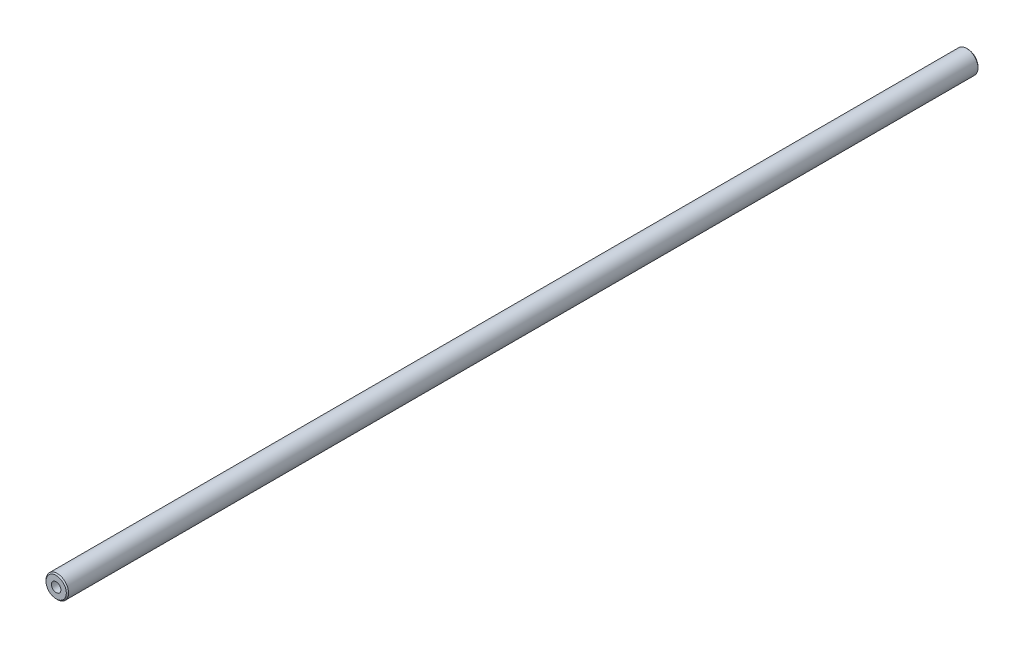
ISO-10303-21;
HEADER;
FILE_DESCRIPTION(('STEP AP214'),'2;1');
FILE_NAME('part.step','',(''),(''),'','','');
FILE_SCHEMA(('AUTOMOTIVE_DESIGN { 1 0 10303 214 1 1 1 1 }'));
ENDSEC;
DATA;
#1=APPLICATION_CONTEXT('core data for automotive mechanical design processes');
#2=APPLICATION_PROTOCOL_DEFINITION('international standard','automotive_design',2000,#1);
#3=PRODUCT_CONTEXT('',#1,'mechanical');
#4=PRODUCT('Part','Part','',(#3));
#5=PRODUCT_RELATED_PRODUCT_CATEGORY('part','',(#4));
#6=PRODUCT_DEFINITION_FORMATION('','',#4);
#7=PRODUCT_DEFINITION_CONTEXT('part definition',#1,'design');
#8=PRODUCT_DEFINITION('design','',#6,#7);
#9=PRODUCT_DEFINITION_SHAPE('','',#8);
#10=(LENGTH_UNIT() NAMED_UNIT(*) SI_UNIT(.MILLI.,.METRE.));
#11=(NAMED_UNIT(*) PLANE_ANGLE_UNIT() SI_UNIT($,.RADIAN.));
#12=(NAMED_UNIT(*) SI_UNIT($,.STERADIAN.) SOLID_ANGLE_UNIT());
#13=UNCERTAINTY_MEASURE_WITH_UNIT(LENGTH_MEASURE(1.E-05),#10,'distance_accuracy_value','');
#14=(GEOMETRIC_REPRESENTATION_CONTEXT(3) GLOBAL_UNCERTAINTY_ASSIGNED_CONTEXT((#13)) GLOBAL_UNIT_ASSIGNED_CONTEXT((#10,
#11,#12)) REPRESENTATION_CONTEXT('',''));
#15=CARTESIAN_POINT('',(0.,0.,0.));
#16=DIRECTION('',(0.,0.,1.));
#17=DIRECTION('',(1.,0.,0.));
#18=AXIS2_PLACEMENT_3D('',#15,#16,#17);
#19=CARTESIAN_POINT('',(0.,0.,403.4811));
#20=DIRECTION('',(0.,0.,-1.));
#21=DIRECTION('',(-1.,0.,0.));
#22=AXIS2_PLACEMENT_3D('',#19,#20,#21);
#23=CYLINDRICAL_SURFACE('',#22,5.00000000000001);
#24=CARTESIAN_POINT('',(0.,0.,0.5));
#25=DIRECTION('',(0.,0.,1.));
#26=DIRECTION('',(1.,0.,0.));
#27=AXIS2_PLACEMENT_3D('',#24,#25,#26);
#28=CIRCLE('',#27,5.00000000000001);
#29=CARTESIAN_POINT('',(5.00000000000001,0.,0.5));
#30=VERTEX_POINT('',#29);
#31=EDGE_CURVE('E75',#30,#30,#28,.T.);
#32=ORIENTED_EDGE('',*,*,#31,.T.);
#33=EDGE_LOOP('',(#32));
#34=FACE_BOUND('',#33,.T.);
#35=CARTESIAN_POINT('',(0.,0.,402.9811));
#36=DIRECTION('',(0.,0.,1.));
#37=DIRECTION('',(1.,0.,0.));
#38=AXIS2_PLACEMENT_3D('',#35,#36,#37);
#39=CIRCLE('',#38,5.00000000000001);
#40=CARTESIAN_POINT('',(5.00000000000001,0.,402.9811));
#41=VERTEX_POINT('',#40);
#42=EDGE_CURVE('E72',#41,#41,#39,.F.);
#43=ORIENTED_EDGE('',*,*,#42,.T.);
#44=EDGE_LOOP('',(#43));
#45=FACE_BOUND('',#44,.T.);
#46=ADVANCED_FACE('F37',(#34,#45),#23,.T.);
#47=CARTESIAN_POINT('',(0.,0.,403.4811));
#48=DIRECTION('',(0.,0.,1.));
#49=DIRECTION('',(1.,0.,0.));
#50=AXIS2_PLACEMENT_3D('',#47,#48,#49);
#51=PLANE('',#50);
#52=CARTESIAN_POINT('',(0.,0.,403.4811));
#53=DIRECTION('',(0.,0.,1.));
#54=DIRECTION('',(1.,0.,0.));
#55=AXIS2_PLACEMENT_3D('',#52,#53,#54);
#56=CIRCLE('',#55,2.09999999999999);
#57=CARTESIAN_POINT('',(2.09999999999999,0.,403.4811));
#58=VERTEX_POINT('',#57);
#59=EDGE_CURVE('E62',#58,#58,#56,.T.);
#60=ORIENTED_EDGE('',*,*,#59,.F.);
#61=EDGE_LOOP('',(#60));
#62=FACE_BOUND('',#61,.T.);
#63=CARTESIAN_POINT('',(0.,0.,403.4811));
#64=DIRECTION('',(0.,0.,1.));
#65=DIRECTION('',(1.,0.,0.));
#66=AXIS2_PLACEMENT_3D('',#63,#64,#65);
#67=CIRCLE('',#66,4.50000000000006);
#68=CARTESIAN_POINT('',(4.50000000000006,0.,403.4811));
#69=VERTEX_POINT('',#68);
#70=EDGE_CURVE('E11',#69,#69,#67,.T.);
#71=ORIENTED_EDGE('',*,*,#70,.T.);
#72=EDGE_LOOP('',(#71));
#73=FACE_BOUND('',#72,.T.);
#74=ADVANCED_FACE('F89',(#62,#73),#51,.T.);
#75=CARTESIAN_POINT('',(0.,0.,0.));
#76=DIRECTION('',(0.,0.,1.));
#77=DIRECTION('',(1.,0.,0.));
#78=AXIS2_PLACEMENT_3D('',#75,#76,#77);
#79=PLANE('',#78);
#80=CARTESIAN_POINT('',(0.,0.,0.));
#81=DIRECTION('',(0.,0.,-1.));
#82=DIRECTION('',(-1.,0.,0.));
#83=AXIS2_PLACEMENT_3D('',#80,#81,#82);
#84=CIRCLE('',#83,2.09999999999999);
#85=CARTESIAN_POINT('',(-2.09999999999999,0.,0.));
#86=VERTEX_POINT('',#85);
#87=EDGE_CURVE('E61',#86,#86,#84,.T.);
#88=ORIENTED_EDGE('',*,*,#87,.F.);
#89=EDGE_LOOP('',(#88));
#90=FACE_BOUND('',#89,.T.);
#91=CARTESIAN_POINT('',(0.,0.,0.));
#92=DIRECTION('',(0.,0.,1.));
#93=DIRECTION('',(1.,0.,0.));
#94=AXIS2_PLACEMENT_3D('',#91,#92,#93);
#95=CIRCLE('',#94,4.5);
#96=CARTESIAN_POINT('',(4.5,0.,0.));
#97=VERTEX_POINT('',#96);
#98=EDGE_CURVE('E45',#97,#97,#95,.F.);
#99=ORIENTED_EDGE('',*,*,#98,.T.);
#100=EDGE_LOOP('',(#99));
#101=FACE_BOUND('',#100,.T.);
#102=ADVANCED_FACE('F80',(#90,#101),#79,.F.);
#103=CARTESIAN_POINT('',(0.,0.,0.5));
#104=DIRECTION('',(0.,0.,1.));
#105=DIRECTION('',(1.,0.,0.));
#106=AXIS2_PLACEMENT_3D('',#103,#104,#105);
#107=CONICAL_SURFACE('',#106,5.00000000000001,0.785398163397449);
#108=ORIENTED_EDGE('',*,*,#98,.F.);
#109=EDGE_LOOP('',(#108));
#110=FACE_BOUND('',#109,.T.);
#111=ORIENTED_EDGE('',*,*,#31,.F.);
#112=EDGE_LOOP('',(#111));
#113=FACE_BOUND('',#112,.T.);
#114=ADVANCED_FACE('F82',(#110,#113),#107,.T.);
#115=CARTESIAN_POINT('',(0.,0.,403.4811));
#116=DIRECTION('',(0.,0.,-1.));
#117=DIRECTION('',(-1.,0.,0.));
#118=AXIS2_PLACEMENT_3D('',#115,#116,#117);
#119=CONICAL_SURFACE('',#118,4.50000000000006,0.785398163397449);
#120=ORIENTED_EDGE('',*,*,#42,.F.);
#121=EDGE_LOOP('',(#120));
#122=FACE_BOUND('',#121,.T.);
#123=ORIENTED_EDGE('',*,*,#70,.F.);
#124=EDGE_LOOP('',(#123));
#125=FACE_BOUND('',#124,.T.);
#126=ADVANCED_FACE('F39',(#122,#125),#119,.T.);
#127=CARTESIAN_POINT('',(0.,0.,16.4));
#128=DIRECTION('',(0.,0.,-1.));
#129=DIRECTION('',(-1.,0.,0.));
#130=AXIS2_PLACEMENT_3D('',#127,#128,#129);
#131=CONICAL_SURFACE('',#130,2.1,1.02974425867665);
#132=CARTESIAN_POINT('',(0.,0.,17.6618072999579));
#133=VERTEX_POINT('',#132);
#134=VERTEX_LOOP('',#133);
#135=FACE_BOUND('',#134,.T.);
#136=CARTESIAN_POINT('',(0.,0.,16.4));
#137=DIRECTION('',(0.,0.,-1.));
#138=DIRECTION('',(-1.,0.,0.));
#139=AXIS2_PLACEMENT_3D('',#136,#137,#138);
#140=CIRCLE('',#139,2.1);
#141=CARTESIAN_POINT('',(-2.1,0.,16.4));
#142=VERTEX_POINT('',#141);
#143=EDGE_CURVE('E65',#142,#142,#140,.T.);
#144=ORIENTED_EDGE('',*,*,#143,.T.);
#145=EDGE_LOOP('',(#144));
#146=FACE_BOUND('',#145,.T.);
#147=ADVANCED_FACE('F95',(#135,#146),#131,.F.);
#148=CARTESIAN_POINT('',(0.,0.,0.));
#149=DIRECTION('',(0.,0.,-1.));
#150=DIRECTION('',(-1.,0.,0.));
#151=AXIS2_PLACEMENT_3D('',#148,#149,#150);
#152=CYLINDRICAL_SURFACE('',#151,2.09999999999999);
#153=ORIENTED_EDGE('',*,*,#143,.F.);
#154=EDGE_LOOP('',(#153));
#155=FACE_BOUND('',#154,.T.);
#156=ORIENTED_EDGE('',*,*,#87,.T.);
#157=EDGE_LOOP('',(#156));
#158=FACE_BOUND('',#157,.T.);
#159=ADVANCED_FACE('F55',(#155,#158),#152,.F.);
#160=CARTESIAN_POINT('',(0.,0.,387.0811));
#161=DIRECTION('',(0.,0.,1.));
#162=DIRECTION('',(1.,0.,0.));
#163=AXIS2_PLACEMENT_3D('',#160,#161,#162);
#164=CONICAL_SURFACE('',#163,2.1,1.02974425867665);
#165=CARTESIAN_POINT('',(0.,0.,385.819292700042));
#166=VERTEX_POINT('',#165);
#167=VERTEX_LOOP('',#166);
#168=FACE_BOUND('',#167,.T.);
#169=CARTESIAN_POINT('',(0.,0.,387.0811));
#170=DIRECTION('',(0.,0.,1.));
#171=DIRECTION('',(1.,0.,0.));
#172=AXIS2_PLACEMENT_3D('',#169,#170,#171);
#173=CIRCLE('',#172,2.1);
#174=CARTESIAN_POINT('',(2.1,0.,387.0811));
#175=VERTEX_POINT('',#174);
#176=EDGE_CURVE('E59',#175,#175,#173,.T.);
#177=ORIENTED_EDGE('',*,*,#176,.T.);
#178=EDGE_LOOP('',(#177));
#179=FACE_BOUND('',#178,.T.);
#180=ADVANCED_FACE('F51',(#168,#179),#164,.F.);
#181=CARTESIAN_POINT('',(0.,0.,403.4811));
#182=DIRECTION('',(0.,0.,1.));
#183=DIRECTION('',(1.,0.,0.));
#184=AXIS2_PLACEMENT_3D('',#181,#182,#183);
#185=CYLINDRICAL_SURFACE('',#184,2.09999999999999);
#186=ORIENTED_EDGE('',*,*,#176,.F.);
#187=EDGE_LOOP('',(#186));
#188=FACE_BOUND('',#187,.T.);
#189=ORIENTED_EDGE('',*,*,#59,.T.);
#190=EDGE_LOOP('',(#189));
#191=FACE_BOUND('',#190,.T.);
#192=ADVANCED_FACE('F54',(#188,#191),#185,.F.);
#193=CLOSED_SHELL('',(#46,#74,#102,#114,#126,#147,#159,#180,#192));
#194=MANIFOLD_SOLID_BREP('B2',#193);
#195=ADVANCED_BREP_SHAPE_REPRESENTATION('',(#18,#194),#14);
#196=SHAPE_DEFINITION_REPRESENTATION(#9,#195);
ENDSEC;
END-ISO-10303-21;
